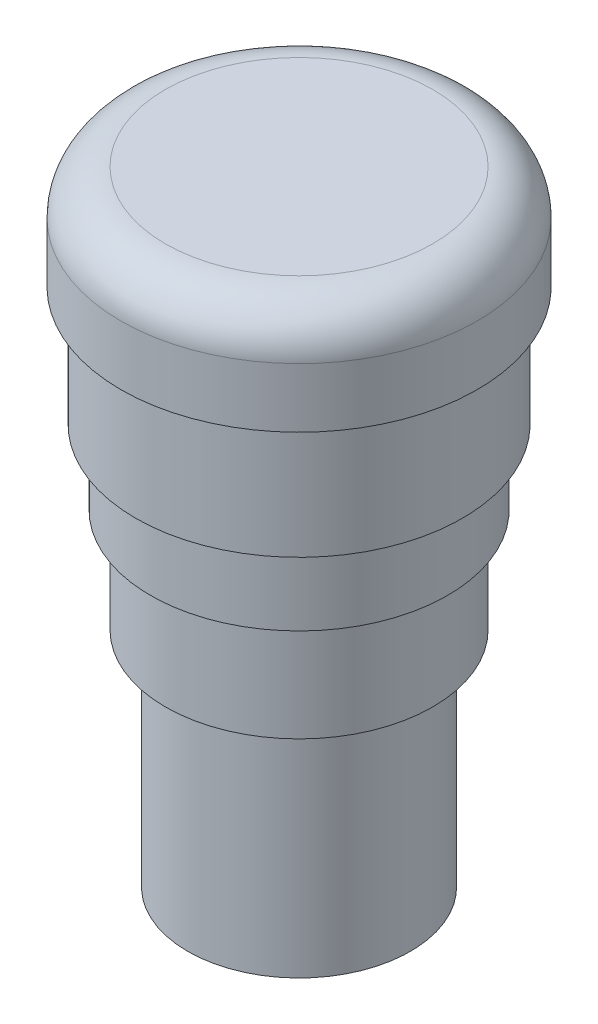
ISO-10303-21;
HEADER;
FILE_DESCRIPTION(('STEP AP214'),'2;1');
FILE_NAME('part.step','',(''),(''),'','','');
FILE_SCHEMA(('AUTOMOTIVE_DESIGN { 1 0 10303 214 1 1 1 1 }'));
ENDSEC;
DATA;
#1=APPLICATION_CONTEXT('core data for automotive mechanical design processes');
#2=APPLICATION_PROTOCOL_DEFINITION('international standard','automotive_design',2000,#1);
#3=PRODUCT_CONTEXT('',#1,'mechanical');
#4=PRODUCT('Part','Part','',(#3));
#5=PRODUCT_RELATED_PRODUCT_CATEGORY('part','',(#4));
#6=PRODUCT_DEFINITION_FORMATION('','',#4);
#7=PRODUCT_DEFINITION_CONTEXT('part definition',#1,'design');
#8=PRODUCT_DEFINITION('design','',#6,#7);
#9=PRODUCT_DEFINITION_SHAPE('','',#8);
#10=(LENGTH_UNIT() NAMED_UNIT(*) SI_UNIT(.MILLI.,.METRE.));
#11=(NAMED_UNIT(*) PLANE_ANGLE_UNIT() SI_UNIT($,.RADIAN.));
#12=(NAMED_UNIT(*) SI_UNIT($,.STERADIAN.) SOLID_ANGLE_UNIT());
#13=UNCERTAINTY_MEASURE_WITH_UNIT(LENGTH_MEASURE(1.E-05),#10,'distance_accuracy_value','');
#14=(GEOMETRIC_REPRESENTATION_CONTEXT(3) GLOBAL_UNCERTAINTY_ASSIGNED_CONTEXT((#13)) GLOBAL_UNIT_ASSIGNED_CONTEXT((#10,
#11,#12)) REPRESENTATION_CONTEXT('',''));
#15=CARTESIAN_POINT('',(0.,0.,0.));
#16=DIRECTION('',(0.,0.,1.));
#17=DIRECTION('',(1.,0.,0.));
#18=AXIS2_PLACEMENT_3D('',#15,#16,#17);
#19=CARTESIAN_POINT('',(0.,-20.,0.));
#20=DIRECTION('',(0.,-1.,0.));
#21=DIRECTION('',(0.,0.,-1.));
#22=AXIS2_PLACEMENT_3D('',#19,#20,#21);
#23=PLANE('',#22);
#24=CARTESIAN_POINT('',(0.,-20.,0.));
#25=DIRECTION('',(0.,-1.,0.));
#26=DIRECTION('',(0.,0.,-1.));
#27=AXIS2_PLACEMENT_3D('',#24,#25,#26);
#28=CIRCLE('',#27,9.);
#29=CARTESIAN_POINT('',(0.,-20.,-9.));
#30=VERTEX_POINT('',#29);
#31=EDGE_CURVE('E56',#30,#30,#28,.T.);
#32=ORIENTED_EDGE('',*,*,#31,.T.);
#33=EDGE_LOOP('',(#32));
#34=FACE_BOUND('',#33,.T.);
#35=CARTESIAN_POINT('',(0.,-20.,0.));
#36=DIRECTION('',(0.,-1.,0.));
#37=DIRECTION('',(0.,0.,-1.));
#38=AXIS2_PLACEMENT_3D('',#35,#36,#37);
#39=CIRCLE('',#38,7.5);
#40=CARTESIAN_POINT('',(0.,-20.,-7.5));
#41=VERTEX_POINT('',#40);
#42=EDGE_CURVE('E65',#41,#41,#39,.T.);
#43=ORIENTED_EDGE('',*,*,#42,.F.);
#44=EDGE_LOOP('',(#43));
#45=FACE_BOUND('',#44,.T.);
#46=ADVANCED_FACE('F29',(#34,#45),#23,.T.);
#47=CARTESIAN_POINT('',(0.,-13.,0.));
#48=DIRECTION('',(0.,-1.,0.));
#49=DIRECTION('',(0.,0.,-1.));
#50=AXIS2_PLACEMENT_3D('',#47,#48,#49);
#51=PLANE('',#50);
#52=CARTESIAN_POINT('',(0.,-13.,0.));
#53=DIRECTION('',(0.,-1.,0.));
#54=DIRECTION('',(0.,0.,-1.));
#55=AXIS2_PLACEMENT_3D('',#52,#53,#54);
#56=CIRCLE('',#55,10.);
#57=CARTESIAN_POINT('',(0.,-13.,-10.));
#58=VERTEX_POINT('',#57);
#59=EDGE_CURVE('E52',#58,#58,#56,.T.);
#60=ORIENTED_EDGE('',*,*,#59,.T.);
#61=EDGE_LOOP('',(#60));
#62=FACE_BOUND('',#61,.T.);
#63=CARTESIAN_POINT('',(0.,-13.,0.));
#64=DIRECTION('',(0.,-1.,0.));
#65=DIRECTION('',(0.,0.,-1.));
#66=AXIS2_PLACEMENT_3D('',#63,#64,#65);
#67=CIRCLE('',#66,9.);
#68=CARTESIAN_POINT('',(0.,-13.,-9.));
#69=VERTEX_POINT('',#68);
#70=EDGE_CURVE('E59',#69,#69,#67,.T.);
#71=ORIENTED_EDGE('',*,*,#70,.F.);
#72=EDGE_LOOP('',(#71));
#73=FACE_BOUND('',#72,.T.);
#74=ADVANCED_FACE('F81',(#62,#73),#51,.T.);
#75=CARTESIAN_POINT('',(0.,-8.,0.));
#76=DIRECTION('',(0.,-1.,0.));
#77=DIRECTION('',(0.,0.,-1.));
#78=AXIS2_PLACEMENT_3D('',#75,#76,#77);
#79=PLANE('',#78);
#80=CARTESIAN_POINT('',(0.,-8.,0.));
#81=DIRECTION('',(0.,-1.,0.));
#82=DIRECTION('',(0.,0.,-1.));
#83=AXIS2_PLACEMENT_3D('',#80,#81,#82);
#84=CIRCLE('',#83,11.);
#85=CARTESIAN_POINT('',(0.,-8.,-11.));
#86=VERTEX_POINT('',#85);
#87=EDGE_CURVE('E49',#86,#86,#84,.T.);
#88=ORIENTED_EDGE('',*,*,#87,.T.);
#89=EDGE_LOOP('',(#88));
#90=FACE_BOUND('',#89,.T.);
#91=CARTESIAN_POINT('',(0.,-8.,0.));
#92=DIRECTION('',(0.,-1.,0.));
#93=DIRECTION('',(0.,0.,-1.));
#94=AXIS2_PLACEMENT_3D('',#91,#92,#93);
#95=CIRCLE('',#94,10.);
#96=CARTESIAN_POINT('',(0.,-8.,-10.));
#97=VERTEX_POINT('',#96);
#98=EDGE_CURVE('E53',#97,#97,#95,.T.);
#99=ORIENTED_EDGE('',*,*,#98,.F.);
#100=EDGE_LOOP('',(#99));
#101=FACE_BOUND('',#100,.T.);
#102=ADVANCED_FACE('F87',(#90,#101),#79,.T.);
#103=CARTESIAN_POINT('',(0.,0.,0.));
#104=DIRECTION('',(0.,1.,0.));
#105=DIRECTION('',(0.,0.,1.));
#106=AXIS2_PLACEMENT_3D('',#103,#104,#105);
#107=PLANE('',#106);
#108=CARTESIAN_POINT('',(0.,0.,0.));
#109=DIRECTION('',(0.,1.,0.));
#110=DIRECTION('',(0.,0.,1.));
#111=AXIS2_PLACEMENT_3D('',#108,#109,#110);
#112=CIRCLE('',#111,12.);
#113=CARTESIAN_POINT('',(0.,0.,12.));
#114=VERTEX_POINT('',#113);
#115=EDGE_CURVE('E44',#114,#114,#112,.T.);
#116=ORIENTED_EDGE('',*,*,#115,.F.);
#117=EDGE_LOOP('',(#116));
#118=FACE_BOUND('',#117,.T.);
#119=CARTESIAN_POINT('',(0.,0.,0.));
#120=DIRECTION('',(0.,1.,0.));
#121=DIRECTION('',(0.,0.,1.));
#122=AXIS2_PLACEMENT_3D('',#119,#120,#121);
#123=CIRCLE('',#122,11.);
#124=CARTESIAN_POINT('',(0.,0.,11.));
#125=VERTEX_POINT('',#124);
#126=EDGE_CURVE('E40',#125,#125,#123,.F.);
#127=ORIENTED_EDGE('',*,*,#126,.F.);
#128=EDGE_LOOP('',(#127));
#129=FACE_BOUND('',#128,.T.);
#130=ADVANCED_FACE('F101',(#118,#129),#107,.F.);
#131=CARTESIAN_POINT('',(0.,7.,0.));
#132=DIRECTION('',(0.,-1.,0.));
#133=DIRECTION('',(0.,0.,-1.));
#134=AXIS2_PLACEMENT_3D('',#131,#132,#133);
#135=CYLINDRICAL_SURFACE('',#134,12.);
#136=CARTESIAN_POINT('',(0.,4.,0.));
#137=DIRECTION('',(0.,1.,0.));
#138=DIRECTION('',(0.,0.,1.));
#139=AXIS2_PLACEMENT_3D('',#136,#137,#138);
#140=CIRCLE('',#139,12.);
#141=CARTESIAN_POINT('',(0.,4.,12.));
#142=VERTEX_POINT('',#141);
#143=EDGE_CURVE('E10',#142,#142,#140,.F.);
#144=ORIENTED_EDGE('',*,*,#143,.T.);
#145=EDGE_LOOP('',(#144));
#146=FACE_BOUND('',#145,.T.);
#147=ORIENTED_EDGE('',*,*,#115,.T.);
#148=EDGE_LOOP('',(#147));
#149=FACE_BOUND('',#148,.T.);
#150=ADVANCED_FACE('F110',(#146,#149),#135,.T.);
#151=CARTESIAN_POINT('',(0.,7.,0.));
#152=DIRECTION('',(0.,1.,0.));
#153=DIRECTION('',(0.,0.,1.));
#154=AXIS2_PLACEMENT_3D('',#151,#152,#153);
#155=PLANE('',#154);
#156=CARTESIAN_POINT('',(0.,7.,0.));
#157=DIRECTION('',(0.,1.,0.));
#158=DIRECTION('',(0.,0.,1.));
#159=AXIS2_PLACEMENT_3D('',#156,#157,#158);
#160=CIRCLE('',#159,9.);
#161=CARTESIAN_POINT('',(0.,7.,9.));
#162=VERTEX_POINT('',#161);
#163=EDGE_CURVE('E36',#162,#162,#160,.T.);
#164=ORIENTED_EDGE('',*,*,#163,.T.);
#165=EDGE_LOOP('',(#164));
#166=FACE_BOUND('',#165,.T.);
#167=ADVANCED_FACE('F106',(#166),#155,.T.);
#168=CARTESIAN_POINT('',(0.,-8.,0.));
#169=DIRECTION('',(0.,1.,0.));
#170=DIRECTION('',(0.,0.,1.));
#171=AXIS2_PLACEMENT_3D('',#168,#169,#170);
#172=CYLINDRICAL_SURFACE('',#171,11.);
#173=ORIENTED_EDGE('',*,*,#87,.F.);
#174=EDGE_LOOP('',(#173));
#175=FACE_BOUND('',#174,.T.);
#176=ORIENTED_EDGE('',*,*,#126,.T.);
#177=EDGE_LOOP('',(#176));
#178=FACE_BOUND('',#177,.T.);
#179=ADVANCED_FACE('F103',(#175,#178),#172,.T.);
#180=CARTESIAN_POINT('',(0.,4.,0.));
#181=DIRECTION('',(0.,1.,0.));
#182=DIRECTION('',(0.,0.,1.));
#183=AXIS2_PLACEMENT_3D('',#180,#181,#182);
#184=TOROIDAL_SURFACE('',#183,9.,3.);
#185=ORIENTED_EDGE('',*,*,#143,.F.);
#186=EDGE_LOOP('',(#185));
#187=FACE_BOUND('',#186,.T.);
#188=ORIENTED_EDGE('',*,*,#163,.F.);
#189=EDGE_LOOP('',(#188));
#190=FACE_BOUND('',#189,.T.);
#191=ADVANCED_FACE('F31',(#187,#190),#184,.T.);
#192=CARTESIAN_POINT('',(0.,-13.,0.));
#193=DIRECTION('',(0.,1.,0.));
#194=DIRECTION('',(0.,0.,1.));
#195=AXIS2_PLACEMENT_3D('',#192,#193,#194);
#196=CYLINDRICAL_SURFACE('',#195,10.);
#197=ORIENTED_EDGE('',*,*,#59,.F.);
#198=EDGE_LOOP('',(#197));
#199=FACE_BOUND('',#198,.T.);
#200=ORIENTED_EDGE('',*,*,#98,.T.);
#201=EDGE_LOOP('',(#200));
#202=FACE_BOUND('',#201,.T.);
#203=ADVANCED_FACE('F93',(#199,#202),#196,.T.);
#204=CARTESIAN_POINT('',(0.,-20.,0.));
#205=DIRECTION('',(0.,1.,0.));
#206=DIRECTION('',(0.,0.,1.));
#207=AXIS2_PLACEMENT_3D('',#204,#205,#206);
#208=CYLINDRICAL_SURFACE('',#207,9.);
#209=ORIENTED_EDGE('',*,*,#31,.F.);
#210=EDGE_LOOP('',(#209));
#211=FACE_BOUND('',#210,.T.);
#212=ORIENTED_EDGE('',*,*,#70,.T.);
#213=EDGE_LOOP('',(#212));
#214=FACE_BOUND('',#213,.T.);
#215=ADVANCED_FACE('F76',(#211,#214),#208,.T.);
#216=CARTESIAN_POINT('',(0.,-35.,0.));
#217=DIRECTION('',(0.,1.,0.));
#218=DIRECTION('',(0.,0.,1.));
#219=AXIS2_PLACEMENT_3D('',#216,#217,#218);
#220=CYLINDRICAL_SURFACE('',#219,7.5);
#221=CARTESIAN_POINT('',(0.,-35.,0.));
#222=DIRECTION('',(0.,-1.,0.));
#223=DIRECTION('',(0.,0.,-1.));
#224=AXIS2_PLACEMENT_3D('',#221,#222,#223);
#225=CIRCLE('',#224,7.5);
#226=CARTESIAN_POINT('',(0.,-35.,-7.5));
#227=VERTEX_POINT('',#226);
#228=EDGE_CURVE('E62',#227,#227,#225,.T.);
#229=ORIENTED_EDGE('',*,*,#228,.F.);
#230=EDGE_LOOP('',(#229));
#231=FACE_BOUND('',#230,.T.);
#232=ORIENTED_EDGE('',*,*,#42,.T.);
#233=EDGE_LOOP('',(#232));
#234=FACE_BOUND('',#233,.T.);
#235=ADVANCED_FACE('F73',(#231,#234),#220,.T.);
#236=CARTESIAN_POINT('',(0.,-35.,0.));
#237=DIRECTION('',(0.,-1.,0.));
#238=DIRECTION('',(0.,0.,-1.));
#239=AXIS2_PLACEMENT_3D('',#236,#237,#238);
#240=PLANE('',#239);
#241=ORIENTED_EDGE('',*,*,#228,.T.);
#242=EDGE_LOOP('',(#241));
#243=FACE_BOUND('',#242,.T.);
#244=ADVANCED_FACE('F71',(#243),#240,.T.);
#245=CLOSED_SHELL('',(#46,#74,#102,#130,#150,#167,#179,#191,#203,#215,#235,#244));
#246=MANIFOLD_SOLID_BREP('B2',#245);
#247=ADVANCED_BREP_SHAPE_REPRESENTATION('',(#18,#246),#14);
#248=SHAPE_DEFINITION_REPRESENTATION(#9,#247);
ENDSEC;
END-ISO-10303-21;
